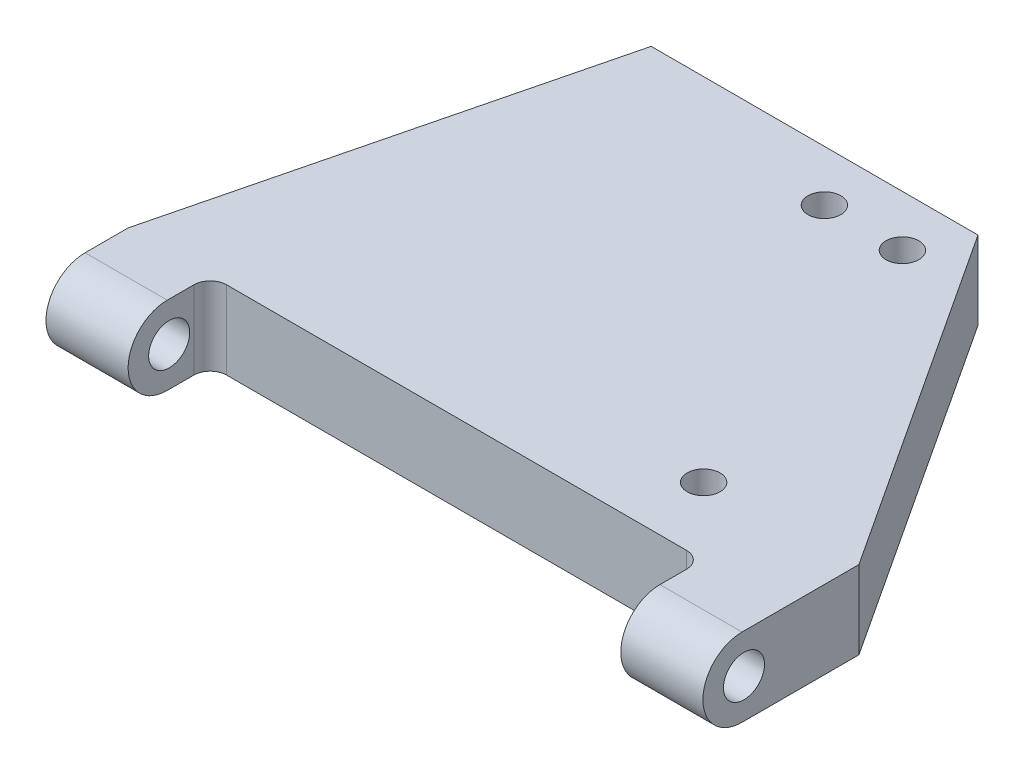
ISO-10303-21;
HEADER;
FILE_DESCRIPTION(('STEP AP214'),'2;1');
FILE_NAME('part.step','',(''),(''),'','','');
FILE_SCHEMA(('AUTOMOTIVE_DESIGN { 1 0 10303 214 1 1 1 1 }'));
ENDSEC;
DATA;
#1=APPLICATION_CONTEXT('core data for automotive mechanical design processes');
#2=APPLICATION_PROTOCOL_DEFINITION('international standard','automotive_design',2000,#1);
#3=PRODUCT_CONTEXT('',#1,'mechanical');
#4=PRODUCT('Part','Part','',(#3));
#5=PRODUCT_RELATED_PRODUCT_CATEGORY('part','',(#4));
#6=PRODUCT_DEFINITION_FORMATION('','',#4);
#7=PRODUCT_DEFINITION_CONTEXT('part definition',#1,'design');
#8=PRODUCT_DEFINITION('design','',#6,#7);
#9=PRODUCT_DEFINITION_SHAPE('','',#8);
#10=(LENGTH_UNIT() NAMED_UNIT(*) SI_UNIT(.MILLI.,.METRE.));
#11=(NAMED_UNIT(*) PLANE_ANGLE_UNIT() SI_UNIT($,.RADIAN.));
#12=(NAMED_UNIT(*) SI_UNIT($,.STERADIAN.) SOLID_ANGLE_UNIT());
#13=UNCERTAINTY_MEASURE_WITH_UNIT(LENGTH_MEASURE(1.E-05),#10,'distance_accuracy_value','');
#14=(GEOMETRIC_REPRESENTATION_CONTEXT(3) GLOBAL_UNCERTAINTY_ASSIGNED_CONTEXT((#13)) GLOBAL_UNIT_ASSIGNED_CONTEXT((#10,
#11,#12)) REPRESENTATION_CONTEXT('',''));
#15=CARTESIAN_POINT('',(0.,0.,0.));
#16=DIRECTION('',(0.,0.,1.));
#17=DIRECTION('',(1.,0.,0.));
#18=AXIS2_PLACEMENT_3D('',#15,#16,#17);
#19=CARTESIAN_POINT('',(140.,9.525,112.475));
#20=DIRECTION('',(1.,0.,0.));
#21=DIRECTION('',(0.,0.,-1.));
#22=AXIS2_PLACEMENT_3D('',#19,#20,#21);
#23=CYLINDRICAL_SURFACE('',#22,9.525);
#24=DIRECTION('',(-1.,0.,0.));
#25=VECTOR('',#24,1.);
#26=CARTESIAN_POINT('',(140.,19.05,112.475));
#27=LINE('',#26,#25);
#28=CARTESIAN_POINT('',(140.,19.05,112.475));
#29=VERTEX_POINT('',#28);
#30=CARTESIAN_POINT('',(160.,19.05,112.475));
#31=VERTEX_POINT('',#30);
#32=EDGE_CURVE('E331',#29,#31,#27,.F.);
#33=ORIENTED_EDGE('',*,*,#32,.F.);
#34=CARTESIAN_POINT('',(140.,9.525,112.475));
#35=DIRECTION('',(1.,0.,0.));
#36=DIRECTION('',(0.,0.,-1.));
#37=AXIS2_PLACEMENT_3D('',#34,#35,#36);
#38=CIRCLE('',#37,9.525);
#39=CARTESIAN_POINT('',(140.,0.,112.475));
#40=VERTEX_POINT('',#39);
#41=EDGE_CURVE('E124',#40,#29,#38,.F.);
#42=ORIENTED_EDGE('',*,*,#41,.F.);
#43=DIRECTION('',(1.,0.,0.));
#44=VECTOR('',#43,1.);
#45=CARTESIAN_POINT('',(0.,0.,112.475));
#46=LINE('',#45,#44);
#47=CARTESIAN_POINT('',(160.,0.,112.475));
#48=VERTEX_POINT('',#47);
#49=EDGE_CURVE('E335',#48,#40,#46,.F.);
#50=ORIENTED_EDGE('',*,*,#49,.F.);
#51=CARTESIAN_POINT('',(160.,9.525,112.475));
#52=DIRECTION('',(-1.,0.,0.));
#53=DIRECTION('',(0.,0.,1.));
#54=AXIS2_PLACEMENT_3D('',#51,#52,#53);
#55=CIRCLE('',#54,9.525);
#56=EDGE_CURVE('E12',#31,#48,#55,.F.);
#57=ORIENTED_EDGE('',*,*,#56,.F.);
#58=EDGE_LOOP('',(#33,#42,#50,#57));
#59=FACE_BOUND('',#58,.T.);
#60=ADVANCED_FACE('F115',(#59),#23,.T.);
#61=CARTESIAN_POINT('',(0.,9.525,112.475));
#62=DIRECTION('',(1.,0.,0.));
#63=DIRECTION('',(0.,0.,-1.));
#64=AXIS2_PLACEMENT_3D('',#61,#62,#63);
#65=CYLINDRICAL_SURFACE('',#64,9.525);
#66=DIRECTION('',(-1.,0.,0.));
#67=VECTOR('',#66,1.);
#68=CARTESIAN_POINT('',(0.,19.05,112.475));
#69=LINE('',#68,#67);
#70=CARTESIAN_POINT('',(0.,19.05,112.475));
#71=VERTEX_POINT('',#70);
#72=CARTESIAN_POINT('',(20.,19.05,112.475));
#73=VERTEX_POINT('',#72);
#74=EDGE_CURVE('E214',#71,#73,#69,.F.);
#75=ORIENTED_EDGE('',*,*,#74,.F.);
#76=CARTESIAN_POINT('',(0.,9.525,112.475));
#77=DIRECTION('',(1.,0.,0.));
#78=DIRECTION('',(0.,0.,-1.));
#79=AXIS2_PLACEMENT_3D('',#76,#77,#78);
#80=CIRCLE('',#79,9.525);
#81=CARTESIAN_POINT('',(0.,0.,112.475));
#82=VERTEX_POINT('',#81);
#83=EDGE_CURVE('E325',#82,#71,#80,.F.);
#84=ORIENTED_EDGE('',*,*,#83,.F.);
#85=DIRECTION('',(1.,0.,0.));
#86=VECTOR('',#85,1.);
#87=CARTESIAN_POINT('',(0.,0.,112.475));
#88=LINE('',#87,#86);
#89=CARTESIAN_POINT('',(20.,0.,112.475));
#90=VERTEX_POINT('',#89);
#91=EDGE_CURVE('E321',#90,#82,#88,.F.);
#92=ORIENTED_EDGE('',*,*,#91,.F.);
#93=CARTESIAN_POINT('',(20.,9.525,112.475));
#94=DIRECTION('',(1.,0.,0.));
#95=DIRECTION('',(0.,0.,-1.));
#96=AXIS2_PLACEMENT_3D('',#93,#94,#95);
#97=CIRCLE('',#96,9.525);
#98=EDGE_CURVE('E328',#73,#90,#97,.T.);
#99=ORIENTED_EDGE('',*,*,#98,.F.);
#100=EDGE_LOOP('',(#75,#84,#92,#99));
#101=FACE_BOUND('',#100,.T.);
#102=ADVANCED_FACE('F372',(#101),#65,.T.);
#103=CARTESIAN_POINT('',(0.,0.,0.));
#104=DIRECTION('',(0.,1.,0.));
#105=DIRECTION('',(0.,0.,1.));
#106=AXIS2_PLACEMENT_3D('',#103,#104,#105);
#107=PLANE('',#106);
#108=CARTESIAN_POINT('',(123.750569229122,0.,85.5773374277373));
#109=DIRECTION('',(0.,1.,0.));
#110=DIRECTION('',(0.,0.,1.));
#111=AXIS2_PLACEMENT_3D('',#108,#109,#110);
#112=CIRCLE('',#111,3.99999999999995);
#113=CARTESIAN_POINT('',(123.750569229122,0.,89.5773374277373));
#114=VERTEX_POINT('',#113);
#115=EDGE_CURVE('E483',#114,#114,#112,.T.);
#116=ORIENTED_EDGE('',*,*,#115,.T.);
#117=EDGE_LOOP('',(#116));
#118=FACE_BOUND('',#117,.T.);
#119=CARTESIAN_POINT('',(80.,0.,12.4141568321594));
#120=DIRECTION('',(0.,-1.,0.));
#121=DIRECTION('',(0.,0.,-1.));
#122=AXIS2_PLACEMENT_3D('',#119,#120,#121);
#123=CIRCLE('',#122,4.00000000000001);
#124=CARTESIAN_POINT('',(80.,0.,8.41415683215943));
#125=VERTEX_POINT('',#124);
#126=EDGE_CURVE('E495',#125,#125,#123,.T.);
#127=ORIENTED_EDGE('',*,*,#126,.F.);
#128=EDGE_LOOP('',(#127));
#129=FACE_BOUND('',#128,.T.);
#130=CARTESIAN_POINT('',(99.,0.,12.4141568321594));
#131=DIRECTION('',(0.,-1.,0.));
#132=DIRECTION('',(0.,0.,-1.));
#133=AXIS2_PLACEMENT_3D('',#130,#131,#132);
#134=CIRCLE('',#133,4.00000000000001);
#135=CARTESIAN_POINT('',(99.,0.,8.41415683215943));
#136=VERTEX_POINT('',#135);
#137=EDGE_CURVE('E439',#136,#136,#134,.T.);
#138=ORIENTED_EDGE('',*,*,#137,.F.);
#139=EDGE_LOOP('',(#138));
#140=FACE_BOUND('',#139,.T.);
#141=DIRECTION('',(0.,0.,-1.));
#142=VECTOR('',#141,1.);
#143=CARTESIAN_POINT('',(160.,0.,1.1686558153949E-13));
#144=LINE('',#143,#142);
#145=CARTESIAN_POINT('',(160.,0.,84.));
#146=VERTEX_POINT('',#145);
#147=EDGE_CURVE('E276',#48,#146,#144,.T.);
#148=ORIENTED_EDGE('',*,*,#147,.F.);
#149=ORIENTED_EDGE('',*,*,#49,.T.);
#150=DIRECTION('',(0.,0.,1.));
#151=VECTOR('',#150,1.);
#152=CARTESIAN_POINT('',(140.,0.,2.42861286636753E-13));
#153=LINE('',#152,#151);
#154=CARTESIAN_POINT('',(140.,0.,106.));
#155=VERTEX_POINT('',#154);
#156=EDGE_CURVE('E272',#155,#40,#153,.T.);
#157=ORIENTED_EDGE('',*,*,#156,.F.);
#158=CARTESIAN_POINT('',(136.,0.,106.));
#159=DIRECTION('',(0.,1.,0.));
#160=DIRECTION('',(0.,0.,1.));
#161=AXIS2_PLACEMENT_3D('',#158,#159,#160);
#162=CIRCLE('',#161,4.00000000000001);
#163=CARTESIAN_POINT('',(136.,0.,102.));
#164=VERTEX_POINT('',#163);
#165=EDGE_CURVE('E268',#164,#155,#162,.F.);
#166=ORIENTED_EDGE('',*,*,#165,.F.);
#167=DIRECTION('',(-1.,0.,0.));
#168=VECTOR('',#167,1.);
#169=CARTESIAN_POINT('',(0.,0.,102.));
#170=LINE('',#169,#168);
#171=CARTESIAN_POINT('',(24.,0.,102.));
#172=VERTEX_POINT('',#171);
#173=EDGE_CURVE('E264',#164,#172,#170,.T.);
#174=ORIENTED_EDGE('',*,*,#173,.T.);
#175=CARTESIAN_POINT('',(24.,0.,106.));
#176=DIRECTION('',(0.,1.,0.));
#177=DIRECTION('',(0.,0.,1.));
#178=AXIS2_PLACEMENT_3D('',#175,#176,#177);
#179=CIRCLE('',#178,4.00000000000001);
#180=CARTESIAN_POINT('',(20.,0.,106.));
#181=VERTEX_POINT('',#180);
#182=EDGE_CURVE('E208',#172,#181,#179,.T.);
#183=ORIENTED_EDGE('',*,*,#182,.T.);
#184=DIRECTION('',(0.,0.,1.));
#185=VECTOR('',#184,1.);
#186=CARTESIAN_POINT('',(20.,0.,0.));
#187=LINE('',#186,#185);
#188=EDGE_CURVE('E227',#181,#90,#187,.T.);
#189=ORIENTED_EDGE('',*,*,#188,.T.);
#190=ORIENTED_EDGE('',*,*,#91,.T.);
#191=DIRECTION('',(0.,0.,1.));
#192=VECTOR('',#191,1.);
#193=CARTESIAN_POINT('',(0.,0.,0.));
#194=LINE('',#193,#192);
#195=CARTESIAN_POINT('',(0.,0.,102.));
#196=VERTEX_POINT('',#195);
#197=EDGE_CURVE('E291',#196,#82,#194,.T.);
#198=ORIENTED_EDGE('',*,*,#197,.F.);
#199=DIRECTION('',(0.241640143717287,0.,-0.97036593146312));
#200=VECTOR('',#199,1.);
#201=CARTESIAN_POINT('',(23.9168950399849,0.,5.95577582368252));
#202=LINE('',#201,#200);
#203=CARTESIAN_POINT('',(25.4,0.,0.));
#204=VERTEX_POINT('',#203);
#205=EDGE_CURVE('E287',#196,#204,#202,.T.);
#206=ORIENTED_EDGE('',*,*,#205,.T.);
#207=DIRECTION('',(-1.,0.,0.));
#208=VECTOR('',#207,1.);
#209=CARTESIAN_POINT('',(0.,0.,0.));
#210=LINE('',#209,#208);
#211=CARTESIAN_POINT('',(105.,0.,0.));
#212=VERTEX_POINT('',#211);
#213=EDGE_CURVE('E283',#212,#204,#210,.T.);
#214=ORIENTED_EDGE('',*,*,#213,.F.);
#215=DIRECTION('',(0.547785941363776,0.,0.836618528628312));
#216=VECTOR('',#215,1.);
#217=CARTESIAN_POINT('',(73.4927090566412,0.,-48.1202261680389));
#218=LINE('',#217,#216);
#219=EDGE_CURVE('E279',#212,#146,#218,.T.);
#220=ORIENTED_EDGE('',*,*,#219,.T.);
#221=EDGE_LOOP('',(#148,#149,#157,#166,#174,#183,#189,#190,#198,#206,#214,#220));
#222=FACE_BOUND('',#221,.T.);
#223=ADVANCED_FACE('F346',(#118,#129,#140,#222),#107,.F.);
#224=CARTESIAN_POINT('',(140.,19.05,2.42861286636753E-13));
#225=DIRECTION('',(1.,0.,0.));
#226=DIRECTION('',(0.,0.,-1.));
#227=AXIS2_PLACEMENT_3D('',#224,#225,#226);
#228=PLANE('',#227);
#229=CARTESIAN_POINT('',(140.,9.525,112.));
#230=DIRECTION('',(1.,0.,0.));
#231=DIRECTION('',(0.,0.,-1.));
#232=AXIS2_PLACEMENT_3D('',#229,#230,#231);
#233=CIRCLE('',#232,5.);
#234=CARTESIAN_POINT('',(140.,9.525,107.));
#235=VERTEX_POINT('',#234);
#236=EDGE_CURVE('E433',#235,#235,#233,.T.);
#237=ORIENTED_EDGE('',*,*,#236,.T.);
#238=EDGE_LOOP('',(#237));
#239=FACE_BOUND('',#238,.T.);
#240=ORIENTED_EDGE('',*,*,#156,.T.);
#241=ORIENTED_EDGE('',*,*,#41,.T.);
#242=DIRECTION('',(0.,0.,1.));
#243=VECTOR('',#242,1.);
#244=CARTESIAN_POINT('',(140.,19.05,2.42861286636753E-13));
#245=LINE('',#244,#243);
#246=CARTESIAN_POINT('',(140.,19.05,106.));
#247=VERTEX_POINT('',#246);
#248=EDGE_CURVE('E235',#247,#29,#245,.T.);
#249=ORIENTED_EDGE('',*,*,#248,.F.);
#250=DIRECTION('',(0.,-1.,0.));
#251=VECTOR('',#250,1.);
#252=CARTESIAN_POINT('',(140.,19.05,106.));
#253=LINE('',#252,#251);
#254=EDGE_CURVE('E313',#247,#155,#253,.T.);
#255=ORIENTED_EDGE('',*,*,#254,.T.);
#256=EDGE_LOOP('',(#240,#241,#249,#255));
#257=FACE_BOUND('',#256,.T.);
#258=ADVANCED_FACE('F339',(#239,#257),#228,.F.);
#259=CARTESIAN_POINT('',(136.,19.05,106.));
#260=DIRECTION('',(0.,-1.,0.));
#261=DIRECTION('',(0.,0.,-1.));
#262=AXIS2_PLACEMENT_3D('',#259,#260,#261);
#263=CYLINDRICAL_SURFACE('',#262,4.00000000000001);
#264=ORIENTED_EDGE('',*,*,#165,.T.);
#265=ORIENTED_EDGE('',*,*,#254,.F.);
#266=CARTESIAN_POINT('',(136.,19.05,106.));
#267=DIRECTION('',(0.,1.,0.));
#268=DIRECTION('',(0.,0.,1.));
#269=AXIS2_PLACEMENT_3D('',#266,#267,#268);
#270=CIRCLE('',#269,4.00000000000001);
#271=CARTESIAN_POINT('',(136.,19.05,102.));
#272=VERTEX_POINT('',#271);
#273=EDGE_CURVE('E232',#272,#247,#270,.F.);
#274=ORIENTED_EDGE('',*,*,#273,.F.);
#275=DIRECTION('',(0.,-1.,0.));
#276=VECTOR('',#275,1.);
#277=CARTESIAN_POINT('',(136.,19.05,102.));
#278=LINE('',#277,#276);
#279=EDGE_CURVE('E215',#272,#164,#278,.T.);
#280=ORIENTED_EDGE('',*,*,#279,.T.);
#281=EDGE_LOOP('',(#264,#265,#274,#280));
#282=FACE_BOUND('',#281,.T.);
#283=ADVANCED_FACE('F342',(#282),#263,.F.);
#284=CARTESIAN_POINT('',(0.,19.05,102.));
#285=DIRECTION('',(0.,0.,1.));
#286=DIRECTION('',(1.,0.,0.));
#287=AXIS2_PLACEMENT_3D('',#284,#285,#286);
#288=PLANE('',#287);
#289=ORIENTED_EDGE('',*,*,#173,.F.);
#290=ORIENTED_EDGE('',*,*,#279,.F.);
#291=DIRECTION('',(-1.,0.,0.));
#292=VECTOR('',#291,1.);
#293=CARTESIAN_POINT('',(0.,19.05,102.));
#294=LINE('',#293,#292);
#295=CARTESIAN_POINT('',(24.,19.05,102.));
#296=VERTEX_POINT('',#295);
#297=EDGE_CURVE('E222',#272,#296,#294,.T.);
#298=ORIENTED_EDGE('',*,*,#297,.T.);
#299=DIRECTION('',(0.,-1.,0.));
#300=VECTOR('',#299,1.);
#301=CARTESIAN_POINT('',(24.,19.05,102.));
#302=LINE('',#301,#300);
#303=EDGE_CURVE('E202',#296,#172,#302,.T.);
#304=ORIENTED_EDGE('',*,*,#303,.T.);
#305=EDGE_LOOP('',(#289,#290,#298,#304));
#306=FACE_BOUND('',#305,.T.);
#307=ADVANCED_FACE('F229',(#306),#288,.T.);
#308=CARTESIAN_POINT('',(24.,19.05,106.));
#309=DIRECTION('',(0.,-1.,0.));
#310=DIRECTION('',(0.,0.,-1.));
#311=AXIS2_PLACEMENT_3D('',#308,#309,#310);
#312=CYLINDRICAL_SURFACE('',#311,4.00000000000001);
#313=ORIENTED_EDGE('',*,*,#182,.F.);
#314=ORIENTED_EDGE('',*,*,#303,.F.);
#315=CARTESIAN_POINT('',(24.,19.05,106.));
#316=DIRECTION('',(0.,1.,0.));
#317=DIRECTION('',(0.,0.,1.));
#318=AXIS2_PLACEMENT_3D('',#315,#316,#317);
#319=CIRCLE('',#318,4.00000000000001);
#320=CARTESIAN_POINT('',(20.,19.05,106.));
#321=VERTEX_POINT('',#320);
#322=EDGE_CURVE('E205',#296,#321,#319,.T.);
#323=ORIENTED_EDGE('',*,*,#322,.T.);
#324=DIRECTION('',(0.,-1.,0.));
#325=VECTOR('',#324,1.);
#326=CARTESIAN_POINT('',(20.,19.05,106.));
#327=LINE('',#326,#325);
#328=EDGE_CURVE('E261',#321,#181,#327,.T.);
#329=ORIENTED_EDGE('',*,*,#328,.T.);
#330=EDGE_LOOP('',(#313,#314,#323,#329));
#331=FACE_BOUND('',#330,.T.);
#332=ADVANCED_FACE('F204',(#331),#312,.F.);
#333=CARTESIAN_POINT('',(20.,19.05,0.));
#334=DIRECTION('',(1.,0.,0.));
#335=DIRECTION('',(0.,0.,-1.));
#336=AXIS2_PLACEMENT_3D('',#333,#334,#335);
#337=PLANE('',#336);
#338=CARTESIAN_POINT('',(20.,9.525,112.));
#339=DIRECTION('',(1.,0.,0.));
#340=DIRECTION('',(0.,0.,-1.));
#341=AXIS2_PLACEMENT_3D('',#338,#339,#340);
#342=CIRCLE('',#341,5.);
#343=CARTESIAN_POINT('',(20.,9.525,107.));
#344=VERTEX_POINT('',#343);
#345=EDGE_CURVE('E427',#344,#344,#342,.T.);
#346=ORIENTED_EDGE('',*,*,#345,.F.);
#347=EDGE_LOOP('',(#346));
#348=FACE_BOUND('',#347,.T.);
#349=DIRECTION('',(0.,0.,1.));
#350=VECTOR('',#349,1.);
#351=CARTESIAN_POINT('',(20.,19.05,0.));
#352=LINE('',#351,#350);
#353=EDGE_CURVE('E225',#321,#73,#352,.T.);
#354=ORIENTED_EDGE('',*,*,#353,.T.);
#355=ORIENTED_EDGE('',*,*,#98,.T.);
#356=ORIENTED_EDGE('',*,*,#188,.F.);
#357=ORIENTED_EDGE('',*,*,#328,.F.);
#358=EDGE_LOOP('',(#354,#355,#356,#357));
#359=FACE_BOUND('',#358,.T.);
#360=ADVANCED_FACE('F369',(#348,#359),#337,.T.);
#361=CARTESIAN_POINT('',(0.,19.05,0.));
#362=DIRECTION('',(1.,0.,0.));
#363=DIRECTION('',(0.,0.,-1.));
#364=AXIS2_PLACEMENT_3D('',#361,#362,#363);
#365=PLANE('',#364);
#366=CARTESIAN_POINT('',(0.,9.525,112.));
#367=DIRECTION('',(-1.,0.,0.));
#368=DIRECTION('',(0.,0.,1.));
#369=AXIS2_PLACEMENT_3D('',#366,#367,#368);
#370=CIRCLE('',#369,5.);
#371=CARTESIAN_POINT('',(0.,9.525,117.));
#372=VERTEX_POINT('',#371);
#373=EDGE_CURVE('E428',#372,#372,#370,.T.);
#374=ORIENTED_EDGE('',*,*,#373,.F.);
#375=EDGE_LOOP('',(#374));
#376=FACE_BOUND('',#375,.T.);
#377=ORIENTED_EDGE('',*,*,#197,.T.);
#378=ORIENTED_EDGE('',*,*,#83,.T.);
#379=DIRECTION('',(0.,0.,1.));
#380=VECTOR('',#379,1.);
#381=CARTESIAN_POINT('',(0.,19.05,0.));
#382=LINE('',#381,#380);
#383=CARTESIAN_POINT('',(0.,19.05,102.));
#384=VERTEX_POINT('',#383);
#385=EDGE_CURVE('E255',#384,#71,#382,.T.);
#386=ORIENTED_EDGE('',*,*,#385,.F.);
#387=DIRECTION('',(0.,-1.,0.));
#388=VECTOR('',#387,1.);
#389=CARTESIAN_POINT('',(0.,19.05,102.));
#390=LINE('',#389,#388);
#391=EDGE_CURVE('E300',#384,#196,#390,.T.);
#392=ORIENTED_EDGE('',*,*,#391,.T.);
#393=EDGE_LOOP('',(#377,#378,#386,#392));
#394=FACE_BOUND('',#393,.T.);
#395=ADVANCED_FACE('F365',(#376,#394),#365,.F.);
#396=CARTESIAN_POINT('',(23.9168950399849,19.05,5.95577582368252));
#397=DIRECTION('',(-0.97036593146312,0.,-0.241640143717287));
#398=DIRECTION('',(-0.241640143717287,0.,0.97036593146312));
#399=AXIS2_PLACEMENT_3D('',#396,#397,#398);
#400=PLANE('',#399);
#401=ORIENTED_EDGE('',*,*,#205,.F.);
#402=ORIENTED_EDGE('',*,*,#391,.F.);
#403=DIRECTION('',(0.241640143717287,0.,-0.97036593146312));
#404=VECTOR('',#403,1.);
#405=CARTESIAN_POINT('',(23.9168950399849,19.05,5.95577582368252));
#406=LINE('',#405,#404);
#407=CARTESIAN_POINT('',(25.4,19.05,0.));
#408=VERTEX_POINT('',#407);
#409=EDGE_CURVE('E251',#384,#408,#406,.T.);
#410=ORIENTED_EDGE('',*,*,#409,.T.);
#411=DIRECTION('',(0.,-1.,0.));
#412=VECTOR('',#411,1.);
#413=CARTESIAN_POINT('',(25.4,19.05,0.));
#414=LINE('',#413,#412);
#415=EDGE_CURVE('E303',#408,#204,#414,.T.);
#416=ORIENTED_EDGE('',*,*,#415,.T.);
#417=EDGE_LOOP('',(#401,#402,#410,#416));
#418=FACE_BOUND('',#417,.T.);
#419=ADVANCED_FACE('F361',(#418),#400,.T.);
#420=CARTESIAN_POINT('',(0.,19.05,0.));
#421=DIRECTION('',(0.,0.,1.));
#422=DIRECTION('',(1.,0.,0.));
#423=AXIS2_PLACEMENT_3D('',#420,#421,#422);
#424=PLANE('',#423);
#425=CARTESIAN_POINT('',(34.925,9.525,0.));
#426=DIRECTION('',(0.,0.,-1.));
#427=DIRECTION('',(-1.,0.,0.));
#428=AXIS2_PLACEMENT_3D('',#425,#426,#427);
#429=CIRCLE('',#428,3.96875);
#430=CARTESIAN_POINT('',(30.95625,9.525,0.));
#431=VERTEX_POINT('',#430);
#432=EDGE_CURVE('E444',#431,#431,#429,.T.);
#433=ORIENTED_EDGE('',*,*,#432,.F.);
#434=EDGE_LOOP('',(#433));
#435=FACE_BOUND('',#434,.T.);
#436=ORIENTED_EDGE('',*,*,#213,.T.);
#437=ORIENTED_EDGE('',*,*,#415,.F.);
#438=DIRECTION('',(-1.,0.,0.));
#439=VECTOR('',#438,1.);
#440=CARTESIAN_POINT('',(0.,19.05,0.));
#441=LINE('',#440,#439);
#442=CARTESIAN_POINT('',(105.,19.05,0.));
#443=VERTEX_POINT('',#442);
#444=EDGE_CURVE('E248',#443,#408,#441,.T.);
#445=ORIENTED_EDGE('',*,*,#444,.F.);
#446=DIRECTION('',(0.,-1.,0.));
#447=VECTOR('',#446,1.);
#448=CARTESIAN_POINT('',(105.,19.05,0.));
#449=LINE('',#448,#447);
#450=EDGE_CURVE('E306',#443,#212,#449,.T.);
#451=ORIENTED_EDGE('',*,*,#450,.T.);
#452=EDGE_LOOP('',(#436,#437,#445,#451));
#453=FACE_BOUND('',#452,.T.);
#454=ADVANCED_FACE('F358',(#435,#453),#424,.F.);
#455=CARTESIAN_POINT('',(73.4927090566412,19.05,-48.1202261680389));
#456=DIRECTION('',(0.836618528628312,0.,-0.547785941363776));
#457=DIRECTION('',(-0.547785941363776,0.,-0.836618528628312));
#458=AXIS2_PLACEMENT_3D('',#455,#456,#457);
#459=PLANE('',#458);
#460=ORIENTED_EDGE('',*,*,#219,.F.);
#461=ORIENTED_EDGE('',*,*,#450,.F.);
#462=DIRECTION('',(0.547785941363776,0.,0.836618528628312));
#463=VECTOR('',#462,1.);
#464=CARTESIAN_POINT('',(73.4927090566412,19.05,-48.1202261680389));
#465=LINE('',#464,#463);
#466=CARTESIAN_POINT('',(160.,19.05,84.));
#467=VERTEX_POINT('',#466);
#468=EDGE_CURVE('E244',#443,#467,#465,.T.);
#469=ORIENTED_EDGE('',*,*,#468,.T.);
#470=DIRECTION('',(0.,-1.,0.));
#471=VECTOR('',#470,1.);
#472=CARTESIAN_POINT('',(160.,19.05,84.));
#473=LINE('',#472,#471);
#474=EDGE_CURVE('E309',#467,#146,#473,.T.);
#475=ORIENTED_EDGE('',*,*,#474,.T.);
#476=EDGE_LOOP('',(#460,#461,#469,#475));
#477=FACE_BOUND('',#476,.T.);
#478=ADVANCED_FACE('F352',(#477),#459,.T.);
#479=CARTESIAN_POINT('',(160.,19.05,1.1686558153949E-13));
#480=DIRECTION('',(-1.,0.,0.));
#481=DIRECTION('',(0.,0.,1.));
#482=AXIS2_PLACEMENT_3D('',#479,#480,#481);
#483=PLANE('',#482);
#484=CARTESIAN_POINT('',(160.,9.525,112.));
#485=DIRECTION('',(-1.,0.,0.));
#486=DIRECTION('',(0.,0.,1.));
#487=AXIS2_PLACEMENT_3D('',#484,#485,#486);
#488=CIRCLE('',#487,5.);
#489=CARTESIAN_POINT('',(160.,9.525,117.));
#490=VERTEX_POINT('',#489);
#491=EDGE_CURVE('E424',#490,#490,#488,.T.);
#492=ORIENTED_EDGE('',*,*,#491,.T.);
#493=EDGE_LOOP('',(#492));
#494=FACE_BOUND('',#493,.T.);
#495=DIRECTION('',(0.,0.,-1.));
#496=VECTOR('',#495,1.);
#497=CARTESIAN_POINT('',(160.,19.05,1.1686558153949E-13));
#498=LINE('',#497,#496);
#499=EDGE_CURVE('E241',#31,#467,#498,.T.);
#500=ORIENTED_EDGE('',*,*,#499,.F.);
#501=ORIENTED_EDGE('',*,*,#56,.T.);
#502=ORIENTED_EDGE('',*,*,#147,.T.);
#503=ORIENTED_EDGE('',*,*,#474,.F.);
#504=EDGE_LOOP('',(#500,#501,#502,#503));
#505=FACE_BOUND('',#504,.T.);
#506=ADVANCED_FACE('F350',(#494,#505),#483,.F.);
#507=CARTESIAN_POINT('',(0.,19.05,0.));
#508=DIRECTION('',(0.,1.,0.));
#509=DIRECTION('',(0.,0.,1.));
#510=AXIS2_PLACEMENT_3D('',#507,#508,#509);
#511=PLANE('',#510);
#512=CARTESIAN_POINT('',(123.750569229122,19.05,85.5773374277373));
#513=DIRECTION('',(0.,1.,0.));
#514=DIRECTION('',(0.,0.,1.));
#515=AXIS2_PLACEMENT_3D('',#512,#513,#514);
#516=CIRCLE('',#515,3.99999999999995);
#517=CARTESIAN_POINT('',(123.750569229122,19.05,89.5773374277373));
#518=VERTEX_POINT('',#517);
#519=EDGE_CURVE('E486',#518,#518,#516,.T.);
#520=ORIENTED_EDGE('',*,*,#519,.F.);
#521=EDGE_LOOP('',(#520));
#522=FACE_BOUND('',#521,.T.);
#523=CARTESIAN_POINT('',(80.,19.05,12.4141568321594));
#524=DIRECTION('',(0.,-1.,0.));
#525=DIRECTION('',(0.,0.,-1.));
#526=AXIS2_PLACEMENT_3D('',#523,#524,#525);
#527=CIRCLE('',#526,4.00000000000001);
#528=CARTESIAN_POINT('',(80.,19.05,8.41415683215943));
#529=VERTEX_POINT('',#528);
#530=EDGE_CURVE('E436',#529,#529,#527,.T.);
#531=ORIENTED_EDGE('',*,*,#530,.T.);
#532=EDGE_LOOP('',(#531));
#533=FACE_BOUND('',#532,.T.);
#534=CARTESIAN_POINT('',(99.,19.05,12.4141568321594));
#535=DIRECTION('',(0.,-1.,0.));
#536=DIRECTION('',(0.,0.,-1.));
#537=AXIS2_PLACEMENT_3D('',#534,#535,#536);
#538=CIRCLE('',#537,4.00000000000001);
#539=CARTESIAN_POINT('',(99.,19.05,8.41415683215943));
#540=VERTEX_POINT('',#539);
#541=EDGE_CURVE('E498',#540,#540,#538,.T.);
#542=ORIENTED_EDGE('',*,*,#541,.T.);
#543=EDGE_LOOP('',(#542));
#544=FACE_BOUND('',#543,.T.);
#545=ORIENTED_EDGE('',*,*,#248,.T.);
#546=ORIENTED_EDGE('',*,*,#32,.T.);
#547=ORIENTED_EDGE('',*,*,#499,.T.);
#548=ORIENTED_EDGE('',*,*,#468,.F.);
#549=ORIENTED_EDGE('',*,*,#444,.T.);
#550=ORIENTED_EDGE('',*,*,#409,.F.);
#551=ORIENTED_EDGE('',*,*,#385,.T.);
#552=ORIENTED_EDGE('',*,*,#74,.T.);
#553=ORIENTED_EDGE('',*,*,#353,.F.);
#554=ORIENTED_EDGE('',*,*,#322,.F.);
#555=ORIENTED_EDGE('',*,*,#297,.F.);
#556=ORIENTED_EDGE('',*,*,#273,.T.);
#557=EDGE_LOOP('',(#545,#546,#547,#548,#549,#550,#551,#552,#553,#554,#555,#556));
#558=FACE_BOUND('',#557,.T.);
#559=ADVANCED_FACE('F220',(#522,#533,#544,#558),#511,.T.);
#560=CARTESIAN_POINT('',(34.925,9.525,38.1));
#561=DIRECTION('',(0.,0.,-1.));
#562=DIRECTION('',(-1.,0.,0.));
#563=AXIS2_PLACEMENT_3D('',#560,#561,#562);
#564=CYLINDRICAL_SURFACE('',#563,3.96875);
#565=CARTESIAN_POINT('',(34.925,9.525,38.1));
#566=DIRECTION('',(0.,0.,-1.));
#567=DIRECTION('',(-1.,0.,0.));
#568=AXIS2_PLACEMENT_3D('',#565,#566,#567);
#569=CIRCLE('',#568,3.96875);
#570=CARTESIAN_POINT('',(30.95625,9.525,38.1));
#571=VERTEX_POINT('',#570);
#572=EDGE_CURVE('E265',#571,#571,#569,.T.);
#573=CARTESIAN_POINT('',(30.95625,9.525,38.1));
#574=CARTESIAN_POINT('',(30.95625,9.525,37.703125));
#575=CARTESIAN_POINT('',(30.95625,9.525,37.30625));
#576=CARTESIAN_POINT('',(30.95625,9.525,36.5125));
#577=CARTESIAN_POINT('',(30.95625,9.525,36.115625));
#578=CARTESIAN_POINT('',(30.95625,9.525,35.321875));
#579=CARTESIAN_POINT('',(30.95625,9.525,34.925));
#580=CARTESIAN_POINT('',(30.95625,9.525,34.13125));
#581=CARTESIAN_POINT('',(30.95625,9.525,33.734375));
#582=CARTESIAN_POINT('',(30.95625,9.525,32.940625));
#583=CARTESIAN_POINT('',(30.95625,9.525,32.54375));
#584=CARTESIAN_POINT('',(30.95625,9.525,31.75));
#585=CARTESIAN_POINT('',(30.95625,9.525,31.353125));
#586=CARTESIAN_POINT('',(30.95625,9.525,30.559375));
#587=CARTESIAN_POINT('',(30.95625,9.525,30.1625));
#588=CARTESIAN_POINT('',(30.95625,9.525,29.36875));
#589=CARTESIAN_POINT('',(30.95625,9.525,28.971875));
#590=CARTESIAN_POINT('',(30.95625,9.525,28.178125));
#591=CARTESIAN_POINT('',(30.95625,9.525,27.78125));
#592=CARTESIAN_POINT('',(30.95625,9.525,26.9875));
#593=CARTESIAN_POINT('',(30.95625,9.525,26.590625));
#594=CARTESIAN_POINT('',(30.95625,9.525,25.796875));
#595=CARTESIAN_POINT('',(30.95625,9.525,25.4));
#596=CARTESIAN_POINT('',(30.95625,9.525,24.60625));
#597=CARTESIAN_POINT('',(30.95625,9.525,24.209375));
#598=CARTESIAN_POINT('',(30.95625,9.525,23.415625));
#599=CARTESIAN_POINT('',(30.95625,9.525,23.01875));
#600=CARTESIAN_POINT('',(30.95625,9.525,22.225));
#601=CARTESIAN_POINT('',(30.95625,9.525,21.828125));
#602=CARTESIAN_POINT('',(30.95625,9.525,21.034375));
#603=CARTESIAN_POINT('',(30.95625,9.525,20.6375));
#604=CARTESIAN_POINT('',(30.95625,9.525,19.84375));
#605=CARTESIAN_POINT('',(30.95625,9.525,19.446875));
#606=CARTESIAN_POINT('',(30.95625,9.525,18.653125));
#607=CARTESIAN_POINT('',(30.95625,9.525,18.25625));
#608=CARTESIAN_POINT('',(30.95625,9.525,17.4625));
#609=CARTESIAN_POINT('',(30.95625,9.525,17.065625));
#610=CARTESIAN_POINT('',(30.95625,9.525,16.271875));
#611=CARTESIAN_POINT('',(30.95625,9.525,15.875));
#612=CARTESIAN_POINT('',(30.95625,9.525,15.08125));
#613=CARTESIAN_POINT('',(30.95625,9.525,14.684375));
#614=CARTESIAN_POINT('',(30.95625,9.525,13.890625));
#615=CARTESIAN_POINT('',(30.95625,9.525,13.49375));
#616=CARTESIAN_POINT('',(30.95625,9.525,12.7));
#617=CARTESIAN_POINT('',(30.95625,9.525,12.303125));
#618=CARTESIAN_POINT('',(30.95625,9.525,11.509375));
#619=CARTESIAN_POINT('',(30.95625,9.525,11.1125));
#620=CARTESIAN_POINT('',(30.95625,9.525,10.31875));
#621=CARTESIAN_POINT('',(30.95625,9.525,9.92187499999999));
#622=CARTESIAN_POINT('',(30.95625,9.525,9.128125));
#623=CARTESIAN_POINT('',(30.95625,9.525,8.73124999999999));
#624=CARTESIAN_POINT('',(30.95625,9.525,7.93749999999999));
#625=CARTESIAN_POINT('',(30.95625,9.525,7.54062499999999));
#626=CARTESIAN_POINT('',(30.95625,9.525,6.74687499999999));
#627=CARTESIAN_POINT('',(30.95625,9.525,6.35));
#628=CARTESIAN_POINT('',(30.95625,9.525,5.55625));
#629=CARTESIAN_POINT('',(30.95625,9.525,5.159375));
#630=CARTESIAN_POINT('',(30.95625,9.525,4.365625));
#631=CARTESIAN_POINT('',(30.95625,9.525,3.96875));
#632=CARTESIAN_POINT('',(30.95625,9.525,3.17499999999999));
#633=CARTESIAN_POINT('',(30.95625,9.525,2.77812499999999));
#634=CARTESIAN_POINT('',(30.95625,9.525,1.98437499999999));
#635=CARTESIAN_POINT('',(30.95625,9.525,1.58749999999999));
#636=CARTESIAN_POINT('',(30.95625,9.525,0.793749999999994));
#637=CARTESIAN_POINT('',(30.95625,9.525,0.396874999999993));
#638=CARTESIAN_POINT('',(30.95625,9.525,0.));
#639=B_SPLINE_CURVE_WITH_KNOTS('',3,(#573,#574,#575,#576,#577,#578,#579,#580,#581,#582,#583,
#584,#585,#586,#587,#588,#589,#590,#591,#592,#593,#594,#595,#596,#597,#598,#599,#600,#601,#602,
#603,#604,#605,#606,#607,#608,#609,#610,#611,#612,#613,#614,#615,#616,#617,#618,#619,#620,#621,
#622,#623,#624,#625,#626,#627,#628,#629,#630,#631,#632,#633,#634,#635,#636,#637,#638),
.UNSPECIFIED.,.F.,.F.,(4,2,2,2,2,2,2,2,2,2,2,2,2,2,2,2,2,2,2,2,2,2,2,2,2,2,2,2,2,2,2,2,4),(0.,
1.19062499999999,2.38124999999999,3.571875,4.7625,5.953125,7.14375,8.334375,9.525,10.715625,
11.90625,13.096875,14.2875,15.478125,16.66875,17.859375,19.05,20.240625,21.43125,22.621875,
23.8125,25.003125,26.19375,27.384375,28.575,29.765625,30.95625,32.146875,33.3375,34.528125,
35.71875,36.909375,38.1),.UNSPECIFIED.);
#640=EDGE_CURVE('BSEAM420',#571,#431,#639,.T.);
#641=ORIENTED_EDGE('',*,*,#572,.F.);
#642=ORIENTED_EDGE('',*,*,#432,.T.);
#643=ORIENTED_EDGE('',*,*,#640,.T.);
#644=ORIENTED_EDGE('',*,*,#640,.F.);
#645=EDGE_LOOP('',(#641,#643,#642,#644));
#646=FACE_BOUND('',#645,.T.);
#647=ADVANCED_FACE('F420',(#646),#564,.F.);
#648=CARTESIAN_POINT('',(34.925,9.525,38.1));
#649=DIRECTION('',(0.,0.,-1.));
#650=DIRECTION('',(-1.,0.,0.));
#651=AXIS2_PLACEMENT_3D('',#648,#649,#650);
#652=PLANE('',#651);
#653=ORIENTED_EDGE('',*,*,#572,.T.);
#654=EDGE_LOOP('',(#653));
#655=FACE_BOUND('',#654,.T.);
#656=ADVANCED_FACE('F452',(#655),#652,.T.);
#657=CARTESIAN_POINT('',(160.,9.525,112.));
#658=DIRECTION('',(-1.,0.,0.));
#659=DIRECTION('',(0.,0.,1.));
#660=AXIS2_PLACEMENT_3D('',#657,#658,#659);
#661=CYLINDRICAL_SURFACE('',#660,5.);
#662=ORIENTED_EDGE('',*,*,#491,.F.);
#663=EDGE_LOOP('',(#662));
#664=FACE_BOUND('',#663,.T.);
#665=ORIENTED_EDGE('',*,*,#236,.F.);
#666=EDGE_LOOP('',(#665));
#667=FACE_BOUND('',#666,.T.);
#668=ADVANCED_FACE('F458',(#664,#667),#661,.F.);
#669=ORIENTED_EDGE('',*,*,#345,.T.);
#670=EDGE_LOOP('',(#669));
#671=FACE_BOUND('',#670,.T.);
#672=ORIENTED_EDGE('',*,*,#373,.T.);
#673=EDGE_LOOP('',(#672));
#674=FACE_BOUND('',#673,.T.);
#675=ADVANCED_FACE('F463',(#671,#674),#661,.F.);
#676=CARTESIAN_POINT('',(99.,19.05,12.4141568321594));
#677=DIRECTION('',(0.,-1.,0.));
#678=DIRECTION('',(0.,0.,-1.));
#679=AXIS2_PLACEMENT_3D('',#676,#677,#678);
#680=CYLINDRICAL_SURFACE('',#679,4.00000000000001);
#681=CARTESIAN_POINT('',(99.,19.05,8.41415683215943));
#682=CARTESIAN_POINT('',(99.,18.8515625,8.41415683215943));
#683=CARTESIAN_POINT('',(99.,18.653125,8.41415683215943));
#684=CARTESIAN_POINT('',(99.,18.25625,8.41415683215943));
#685=CARTESIAN_POINT('',(99.,18.0578125,8.41415683215943));
#686=CARTESIAN_POINT('',(99.,17.6609375,8.41415683215943));
#687=CARTESIAN_POINT('',(99.,17.4625,8.41415683215943));
#688=CARTESIAN_POINT('',(99.,17.065625,8.41415683215943));
#689=CARTESIAN_POINT('',(99.,16.8671875,8.41415683215943));
#690=CARTESIAN_POINT('',(99.,16.4703125,8.41415683215943));
#691=CARTESIAN_POINT('',(99.,16.271875,8.41415683215943));
#692=CARTESIAN_POINT('',(99.,15.875,8.41415683215943));
#693=CARTESIAN_POINT('',(99.,15.6765625,8.41415683215943));
#694=CARTESIAN_POINT('',(99.,15.2796875,8.41415683215943));
#695=CARTESIAN_POINT('',(99.,15.08125,8.41415683215943));
#696=CARTESIAN_POINT('',(99.,14.684375,8.41415683215943));
#697=CARTESIAN_POINT('',(99.,14.4859375,8.41415683215943));
#698=CARTESIAN_POINT('',(99.,14.0890625,8.41415683215943));
#699=CARTESIAN_POINT('',(99.,13.890625,8.41415683215943));
#700=CARTESIAN_POINT('',(99.,13.49375,8.41415683215943));
#701=CARTESIAN_POINT('',(99.,13.2953125,8.41415683215943));
#702=CARTESIAN_POINT('',(99.,12.8984375,8.41415683215943));
#703=CARTESIAN_POINT('',(99.,12.7,8.41415683215943));
#704=CARTESIAN_POINT('',(99.,12.303125,8.41415683215943));
#705=CARTESIAN_POINT('',(99.,12.1046875,8.41415683215943));
#706=CARTESIAN_POINT('',(99.,11.7078125,8.41415683215943));
#707=CARTESIAN_POINT('',(99.,11.509375,8.41415683215943));
#708=CARTESIAN_POINT('',(99.,11.1125,8.41415683215943));
#709=CARTESIAN_POINT('',(99.,10.9140625,8.41415683215943));
#710=CARTESIAN_POINT('',(99.,10.5171875,8.41415683215943));
#711=CARTESIAN_POINT('',(99.,10.31875,8.41415683215943));
#712=CARTESIAN_POINT('',(99.,9.921875,8.41415683215943));
#713=CARTESIAN_POINT('',(99.,9.7234375,8.41415683215943));
#714=CARTESIAN_POINT('',(99.,9.3265625,8.41415683215943));
#715=CARTESIAN_POINT('',(99.,9.128125,8.41415683215943));
#716=CARTESIAN_POINT('',(99.,8.73125,8.41415683215943));
#717=CARTESIAN_POINT('',(99.,8.5328125,8.41415683215943));
#718=CARTESIAN_POINT('',(99.,8.1359375,8.41415683215943));
#719=CARTESIAN_POINT('',(99.,7.9375,8.41415683215943));
#720=CARTESIAN_POINT('',(99.,7.540625,8.41415683215943));
#721=CARTESIAN_POINT('',(99.,7.3421875,8.41415683215943));
#722=CARTESIAN_POINT('',(99.,6.9453125,8.41415683215943));
#723=CARTESIAN_POINT('',(99.,6.746875,8.41415683215943));
#724=CARTESIAN_POINT('',(99.,6.35,8.41415683215943));
#725=CARTESIAN_POINT('',(99.,6.1515625,8.41415683215943));
#726=CARTESIAN_POINT('',(99.,5.7546875,8.41415683215943));
#727=CARTESIAN_POINT('',(99.,5.55625,8.41415683215943));
#728=CARTESIAN_POINT('',(99.,5.159375,8.41415683215943));
#729=CARTESIAN_POINT('',(99.,4.9609375,8.41415683215943));
#730=CARTESIAN_POINT('',(99.,4.5640625,8.41415683215943));
#731=CARTESIAN_POINT('',(99.,4.365625,8.41415683215943));
#732=CARTESIAN_POINT('',(99.,3.96875,8.41415683215943));
#733=CARTESIAN_POINT('',(99.,3.7703125,8.41415683215943));
#734=CARTESIAN_POINT('',(99.,3.3734375,8.41415683215943));
#735=CARTESIAN_POINT('',(99.,3.175,8.41415683215943));
#736=CARTESIAN_POINT('',(99.,2.778125,8.41415683215943));
#737=CARTESIAN_POINT('',(99.,2.5796875,8.41415683215943));
#738=CARTESIAN_POINT('',(99.,2.1828125,8.41415683215943));
#739=CARTESIAN_POINT('',(99.,1.984375,8.41415683215943));
#740=CARTESIAN_POINT('',(99.,1.5875,8.41415683215943));
#741=CARTESIAN_POINT('',(99.,1.3890625,8.41415683215943));
#742=CARTESIAN_POINT('',(99.,0.992187500000001,8.41415683215943));
#743=CARTESIAN_POINT('',(99.,0.793750000000001,8.41415683215943));
#744=CARTESIAN_POINT('',(99.,0.396875,8.41415683215943));
#745=CARTESIAN_POINT('',(99.,0.1984375,8.41415683215943));
#746=CARTESIAN_POINT('',(99.,0.,8.41415683215943));
#747=B_SPLINE_CURVE_WITH_KNOTS('',3,(#681,#682,#683,#684,#685,#686,#687,#688,#689,#690,#691,
#692,#693,#694,#695,#696,#697,#698,#699,#700,#701,#702,#703,#704,#705,#706,#707,#708,#709,#710,
#711,#712,#713,#714,#715,#716,#717,#718,#719,#720,#721,#722,#723,#724,#725,#726,#727,#728,#729,
#730,#731,#732,#733,#734,#735,#736,#737,#738,#739,#740,#741,#742,#743,#744,#745,#746),
.UNSPECIFIED.,.F.,.F.,(4,2,2,2,2,2,2,2,2,2,2,2,2,2,2,2,2,2,2,2,2,2,2,2,2,2,2,2,2,2,2,2,4),(0.,
0.5953125,1.190625,1.7859375,2.38125,2.9765625,3.571875,4.1671875,4.7625,5.3578125,5.953125,
6.5484375,7.14375,7.7390625,8.334375,8.9296875,9.525,10.1203125,10.715625,11.3109375,11.90625,
12.5015625,13.096875,13.6921875,14.2875,14.8828125,15.478125,16.0734375,16.66875,17.2640625,
17.859375,18.4546875,19.05),.UNSPECIFIED.);
#748=EDGE_CURVE('BSEAM466',#540,#136,#747,.T.);
#749=ORIENTED_EDGE('',*,*,#541,.F.);
#750=ORIENTED_EDGE('',*,*,#137,.T.);
#751=ORIENTED_EDGE('',*,*,#748,.T.);
#752=ORIENTED_EDGE('',*,*,#748,.F.);
#753=EDGE_LOOP('',(#749,#751,#750,#752));
#754=FACE_BOUND('',#753,.T.);
#755=ADVANCED_FACE('F466',(#754),#680,.F.);
#756=CARTESIAN_POINT('',(80.,19.05,12.4141568321594));
#757=DIRECTION('',(0.,-1.,0.));
#758=DIRECTION('',(0.,0.,-1.));
#759=AXIS2_PLACEMENT_3D('',#756,#757,#758);
#760=CYLINDRICAL_SURFACE('',#759,4.00000000000001);
#761=CARTESIAN_POINT('',(80.,19.05,8.41415683215943));
#762=CARTESIAN_POINT('',(80.,18.8515625,8.41415683215943));
#763=CARTESIAN_POINT('',(80.,18.653125,8.41415683215943));
#764=CARTESIAN_POINT('',(80.,18.25625,8.41415683215943));
#765=CARTESIAN_POINT('',(80.,18.0578125,8.41415683215943));
#766=CARTESIAN_POINT('',(80.,17.6609375,8.41415683215943));
#767=CARTESIAN_POINT('',(80.,17.4625,8.41415683215943));
#768=CARTESIAN_POINT('',(80.,17.065625,8.41415683215943));
#769=CARTESIAN_POINT('',(80.,16.8671875,8.41415683215943));
#770=CARTESIAN_POINT('',(80.,16.4703125,8.41415683215943));
#771=CARTESIAN_POINT('',(80.,16.271875,8.41415683215943));
#772=CARTESIAN_POINT('',(80.,15.875,8.41415683215943));
#773=CARTESIAN_POINT('',(80.,15.6765625,8.41415683215943));
#774=CARTESIAN_POINT('',(80.,15.2796875,8.41415683215943));
#775=CARTESIAN_POINT('',(80.,15.08125,8.41415683215943));
#776=CARTESIAN_POINT('',(80.,14.684375,8.41415683215943));
#777=CARTESIAN_POINT('',(80.,14.4859375,8.41415683215943));
#778=CARTESIAN_POINT('',(80.,14.0890625,8.41415683215943));
#779=CARTESIAN_POINT('',(80.,13.890625,8.41415683215943));
#780=CARTESIAN_POINT('',(80.,13.49375,8.41415683215943));
#781=CARTESIAN_POINT('',(80.,13.2953125,8.41415683215943));
#782=CARTESIAN_POINT('',(80.,12.8984375,8.41415683215943));
#783=CARTESIAN_POINT('',(80.,12.7,8.41415683215943));
#784=CARTESIAN_POINT('',(80.,12.303125,8.41415683215943));
#785=CARTESIAN_POINT('',(80.,12.1046875,8.41415683215943));
#786=CARTESIAN_POINT('',(80.,11.7078125,8.41415683215943));
#787=CARTESIAN_POINT('',(80.,11.509375,8.41415683215943));
#788=CARTESIAN_POINT('',(80.,11.1125,8.41415683215943));
#789=CARTESIAN_POINT('',(80.,10.9140625,8.41415683215943));
#790=CARTESIAN_POINT('',(80.,10.5171875,8.41415683215943));
#791=CARTESIAN_POINT('',(80.,10.31875,8.41415683215943));
#792=CARTESIAN_POINT('',(80.,9.921875,8.41415683215943));
#793=CARTESIAN_POINT('',(80.,9.7234375,8.41415683215943));
#794=CARTESIAN_POINT('',(80.,9.3265625,8.41415683215943));
#795=CARTESIAN_POINT('',(80.,9.128125,8.41415683215943));
#796=CARTESIAN_POINT('',(80.,8.73125,8.41415683215943));
#797=CARTESIAN_POINT('',(80.,8.5328125,8.41415683215943));
#798=CARTESIAN_POINT('',(80.,8.1359375,8.41415683215943));
#799=CARTESIAN_POINT('',(80.,7.9375,8.41415683215943));
#800=CARTESIAN_POINT('',(80.,7.540625,8.41415683215943));
#801=CARTESIAN_POINT('',(80.,7.3421875,8.41415683215943));
#802=CARTESIAN_POINT('',(80.,6.9453125,8.41415683215943));
#803=CARTESIAN_POINT('',(80.,6.746875,8.41415683215943));
#804=CARTESIAN_POINT('',(80.,6.35,8.41415683215943));
#805=CARTESIAN_POINT('',(80.,6.1515625,8.41415683215943));
#806=CARTESIAN_POINT('',(80.,5.7546875,8.41415683215943));
#807=CARTESIAN_POINT('',(80.,5.55625,8.41415683215943));
#808=CARTESIAN_POINT('',(80.,5.159375,8.41415683215943));
#809=CARTESIAN_POINT('',(80.,4.9609375,8.41415683215943));
#810=CARTESIAN_POINT('',(80.,4.5640625,8.41415683215943));
#811=CARTESIAN_POINT('',(80.,4.365625,8.41415683215943));
#812=CARTESIAN_POINT('',(80.,3.96875,8.41415683215943));
#813=CARTESIAN_POINT('',(80.,3.7703125,8.41415683215943));
#814=CARTESIAN_POINT('',(80.,3.3734375,8.41415683215943));
#815=CARTESIAN_POINT('',(80.,3.175,8.41415683215943));
#816=CARTESIAN_POINT('',(80.,2.778125,8.41415683215943));
#817=CARTESIAN_POINT('',(80.,2.5796875,8.41415683215943));
#818=CARTESIAN_POINT('',(80.,2.1828125,8.41415683215943));
#819=CARTESIAN_POINT('',(80.,1.984375,8.41415683215943));
#820=CARTESIAN_POINT('',(80.,1.5875,8.41415683215943));
#821=CARTESIAN_POINT('',(80.,1.3890625,8.41415683215943));
#822=CARTESIAN_POINT('',(80.,0.992187500000001,8.41415683215943));
#823=CARTESIAN_POINT('',(80.,0.793750000000001,8.41415683215943));
#824=CARTESIAN_POINT('',(80.,0.396875,8.41415683215943));
#825=CARTESIAN_POINT('',(80.,0.1984375,8.41415683215943));
#826=CARTESIAN_POINT('',(80.,0.,8.41415683215943));
#827=B_SPLINE_CURVE_WITH_KNOTS('',3,(#761,#762,#763,#764,#765,#766,#767,#768,#769,#770,#771,
#772,#773,#774,#775,#776,#777,#778,#779,#780,#781,#782,#783,#784,#785,#786,#787,#788,#789,#790,
#791,#792,#793,#794,#795,#796,#797,#798,#799,#800,#801,#802,#803,#804,#805,#806,#807,#808,#809,
#810,#811,#812,#813,#814,#815,#816,#817,#818,#819,#820,#821,#822,#823,#824,#825,#826),
.UNSPECIFIED.,.F.,.F.,(4,2,2,2,2,2,2,2,2,2,2,2,2,2,2,2,2,2,2,2,2,2,2,2,2,2,2,2,2,2,2,2,4),(0.,
0.5953125,1.190625,1.7859375,2.38125,2.9765625,3.571875,4.1671875,4.7625,5.3578125,5.953125,
6.5484375,7.14375,7.7390625,8.334375,8.9296875,9.525,10.1203125,10.715625,11.3109375,11.90625,
12.5015625,13.096875,13.6921875,14.2875,14.8828125,15.478125,16.0734375,16.66875,17.2640625,
17.859375,18.4546875,19.05),.UNSPECIFIED.);
#828=EDGE_CURVE('BSEAM470',#529,#125,#827,.T.);
#829=ORIENTED_EDGE('',*,*,#530,.F.);
#830=ORIENTED_EDGE('',*,*,#126,.T.);
#831=ORIENTED_EDGE('',*,*,#828,.T.);
#832=ORIENTED_EDGE('',*,*,#828,.F.);
#833=EDGE_LOOP('',(#829,#831,#830,#832));
#834=FACE_BOUND('',#833,.T.);
#835=ADVANCED_FACE('F470',(#834),#760,.F.);
#836=CARTESIAN_POINT('',(123.750569229122,0.,85.5773374277373));
#837=DIRECTION('',(0.,1.,0.));
#838=DIRECTION('',(0.,0.,1.));
#839=AXIS2_PLACEMENT_3D('',#836,#837,#838);
#840=CYLINDRICAL_SURFACE('',#839,3.99999999999995);
#841=CARTESIAN_POINT('',(123.750569229122,0.,89.5773374277373));
#842=CARTESIAN_POINT('',(123.750569229122,0.1984375,89.5773374277373));
#843=CARTESIAN_POINT('',(123.750569229122,0.396875,89.5773374277373));
#844=CARTESIAN_POINT('',(123.750569229122,0.79375,89.5773374277373));
#845=CARTESIAN_POINT('',(123.750569229122,0.9921875,89.5773374277373));
#846=CARTESIAN_POINT('',(123.750569229122,1.3890625,89.5773374277373));
#847=CARTESIAN_POINT('',(123.750569229122,1.5875,89.5773374277373));
#848=CARTESIAN_POINT('',(123.750569229122,1.984375,89.5773374277373));
#849=CARTESIAN_POINT('',(123.750569229122,2.1828125,89.5773374277373));
#850=CARTESIAN_POINT('',(123.750569229122,2.5796875,89.5773374277373));
#851=CARTESIAN_POINT('',(123.750569229122,2.778125,89.5773374277373));
#852=CARTESIAN_POINT('',(123.750569229122,3.175,89.5773374277373));
#853=CARTESIAN_POINT('',(123.750569229122,3.3734375,89.5773374277373));
#854=CARTESIAN_POINT('',(123.750569229122,3.7703125,89.5773374277373));
#855=CARTESIAN_POINT('',(123.750569229122,3.96875,89.5773374277373));
#856=CARTESIAN_POINT('',(123.750569229122,4.365625,89.5773374277373));
#857=CARTESIAN_POINT('',(123.750569229122,4.5640625,89.5773374277373));
#858=CARTESIAN_POINT('',(123.750569229122,4.9609375,89.5773374277373));
#859=CARTESIAN_POINT('',(123.750569229122,5.159375,89.5773374277373));
#860=CARTESIAN_POINT('',(123.750569229122,5.55625,89.5773374277373));
#861=CARTESIAN_POINT('',(123.750569229122,5.7546875,89.5773374277373));
#862=CARTESIAN_POINT('',(123.750569229122,6.1515625,89.5773374277373));
#863=CARTESIAN_POINT('',(123.750569229122,6.35,89.5773374277373));
#864=CARTESIAN_POINT('',(123.750569229122,6.746875,89.5773374277373));
#865=CARTESIAN_POINT('',(123.750569229122,6.9453125,89.5773374277373));
#866=CARTESIAN_POINT('',(123.750569229122,7.3421875,89.5773374277373));
#867=CARTESIAN_POINT('',(123.750569229122,7.540625,89.5773374277373));
#868=CARTESIAN_POINT('',(123.750569229122,7.9375,89.5773374277373));
#869=CARTESIAN_POINT('',(123.750569229122,8.1359375,89.5773374277373));
#870=CARTESIAN_POINT('',(123.750569229122,8.5328125,89.5773374277373));
#871=CARTESIAN_POINT('',(123.750569229122,8.73125,89.5773374277373));
#872=CARTESIAN_POINT('',(123.750569229122,9.128125,89.5773374277373));
#873=CARTESIAN_POINT('',(123.750569229122,9.3265625,89.5773374277373));
#874=CARTESIAN_POINT('',(123.750569229122,9.7234375,89.5773374277373));
#875=CARTESIAN_POINT('',(123.750569229122,9.921875,89.5773374277373));
#876=CARTESIAN_POINT('',(123.750569229122,10.31875,89.5773374277373));
#877=CARTESIAN_POINT('',(123.750569229122,10.5171875,89.5773374277373));
#878=CARTESIAN_POINT('',(123.750569229122,10.9140625,89.5773374277373));
#879=CARTESIAN_POINT('',(123.750569229122,11.1125,89.5773374277373));
#880=CARTESIAN_POINT('',(123.750569229122,11.509375,89.5773374277373));
#881=CARTESIAN_POINT('',(123.750569229122,11.7078125,89.5773374277373));
#882=CARTESIAN_POINT('',(123.750569229122,12.1046875,89.5773374277373));
#883=CARTESIAN_POINT('',(123.750569229122,12.303125,89.5773374277373));
#884=CARTESIAN_POINT('',(123.750569229122,12.7,89.5773374277373));
#885=CARTESIAN_POINT('',(123.750569229122,12.8984375,89.5773374277373));
#886=CARTESIAN_POINT('',(123.750569229122,13.2953125,89.5773374277373));
#887=CARTESIAN_POINT('',(123.750569229122,13.49375,89.5773374277373));
#888=CARTESIAN_POINT('',(123.750569229122,13.890625,89.5773374277373));
#889=CARTESIAN_POINT('',(123.750569229122,14.0890625,89.5773374277373));
#890=CARTESIAN_POINT('',(123.750569229122,14.4859375,89.5773374277373));
#891=CARTESIAN_POINT('',(123.750569229122,14.684375,89.5773374277373));
#892=CARTESIAN_POINT('',(123.750569229122,15.08125,89.5773374277373));
#893=CARTESIAN_POINT('',(123.750569229122,15.2796875,89.5773374277373));
#894=CARTESIAN_POINT('',(123.750569229122,15.6765625,89.5773374277373));
#895=CARTESIAN_POINT('',(123.750569229122,15.875,89.5773374277373));
#896=CARTESIAN_POINT('',(123.750569229122,16.271875,89.5773374277373));
#897=CARTESIAN_POINT('',(123.750569229122,16.4703125,89.5773374277373));
#898=CARTESIAN_POINT('',(123.750569229122,16.8671875,89.5773374277373));
#899=CARTESIAN_POINT('',(123.750569229122,17.065625,89.5773374277373));
#900=CARTESIAN_POINT('',(123.750569229122,17.4625,89.5773374277373));
#901=CARTESIAN_POINT('',(123.750569229122,17.6609375,89.5773374277373));
#902=CARTESIAN_POINT('',(123.750569229122,18.0578125,89.5773374277373));
#903=CARTESIAN_POINT('',(123.750569229122,18.25625,89.5773374277373));
#904=CARTESIAN_POINT('',(123.750569229122,18.653125,89.5773374277373));
#905=CARTESIAN_POINT('',(123.750569229122,18.8515625,89.5773374277373));
#906=CARTESIAN_POINT('',(123.750569229122,19.05,89.5773374277373));
#907=B_SPLINE_CURVE_WITH_KNOTS('',3,(#841,#842,#843,#844,#845,#846,#847,#848,#849,#850,#851,
#852,#853,#854,#855,#856,#857,#858,#859,#860,#861,#862,#863,#864,#865,#866,#867,#868,#869,#870,
#871,#872,#873,#874,#875,#876,#877,#878,#879,#880,#881,#882,#883,#884,#885,#886,#887,#888,#889,
#890,#891,#892,#893,#894,#895,#896,#897,#898,#899,#900,#901,#902,#903,#904,#905,#906),
.UNSPECIFIED.,.F.,.F.,(4,2,2,2,2,2,2,2,2,2,2,2,2,2,2,2,2,2,2,2,2,2,2,2,2,2,2,2,2,2,2,2,4),(0.,
0.5953125,1.190625,1.7859375,2.38125,2.9765625,3.571875,4.1671875,4.7625,5.3578125,5.953125,
6.5484375,7.14375,7.7390625,8.334375,8.9296875,9.525,10.1203125,10.715625,11.3109375,11.90625,
12.5015625,13.096875,13.6921875,14.2875,14.8828125,15.478125,16.0734375,16.66875,17.2640625,
17.859375,18.4546875,19.05),.UNSPECIFIED.);
#908=EDGE_CURVE('BSEAM474',#114,#518,#907,.T.);
#909=ORIENTED_EDGE('',*,*,#115,.F.);
#910=ORIENTED_EDGE('',*,*,#519,.T.);
#911=ORIENTED_EDGE('',*,*,#908,.T.);
#912=ORIENTED_EDGE('',*,*,#908,.F.);
#913=EDGE_LOOP('',(#909,#911,#910,#912));
#914=FACE_BOUND('',#913,.T.);
#915=ADVANCED_FACE('F474',(#914),#840,.F.);
#916=CLOSED_SHELL('',(#60,#102,#223,#258,#283,#307,#332,#360,#395,#419,#454,#478,#506,#559,#647,
#656,#668,#675,#755,#835,#915));
#917=MANIFOLD_SOLID_BREP('B2',#916);
#918=ADVANCED_BREP_SHAPE_REPRESENTATION('',(#18,#917),#14);
#919=SHAPE_DEFINITION_REPRESENTATION(#9,#918);
ENDSEC;
END-ISO-10303-21;
